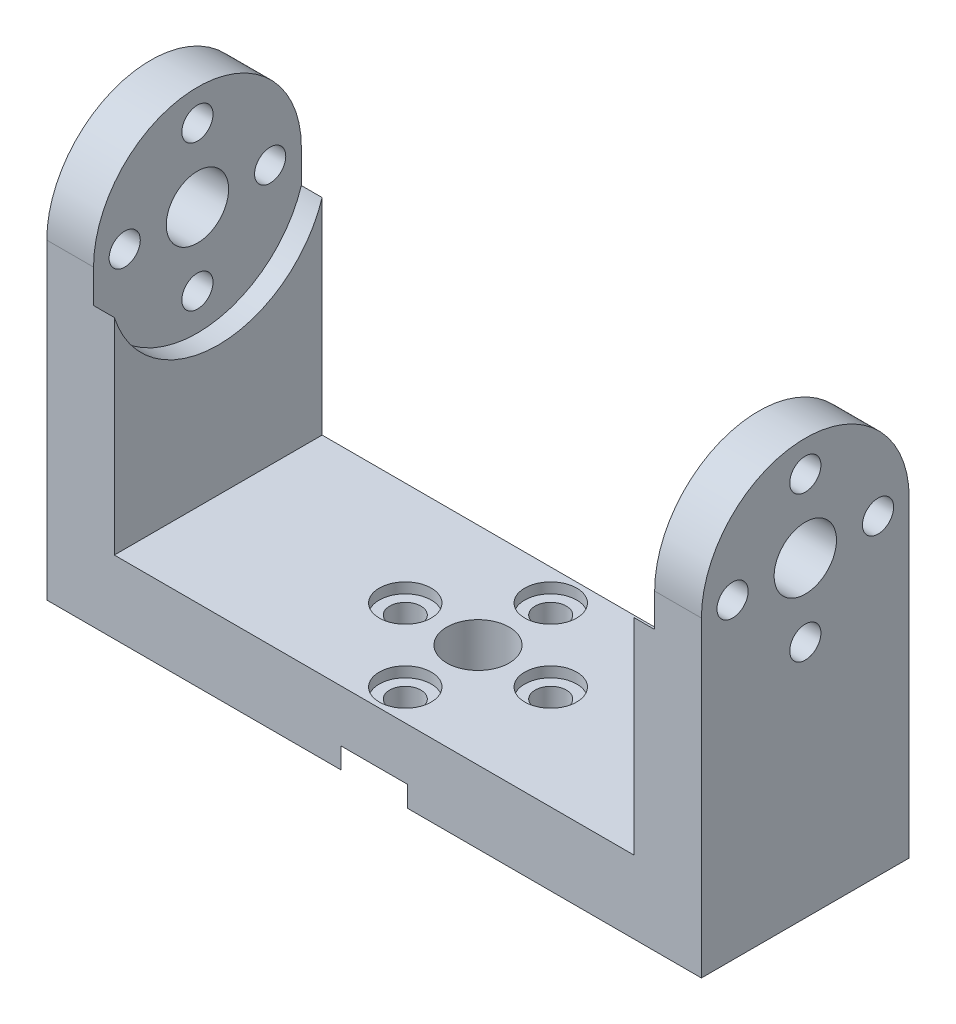
ISO-10303-21;
HEADER;
FILE_DESCRIPTION(('STEP AP214'),'2;1');
FILE_NAME('part.step','',(''),(''),'','','');
FILE_SCHEMA(('AUTOMOTIVE_DESIGN { 1 0 10303 214 1 1 1 1 }'));
ENDSEC;
DATA;
#1=APPLICATION_CONTEXT('core data for automotive mechanical design processes');
#2=APPLICATION_PROTOCOL_DEFINITION('international standard','automotive_design',2000,#1);
#3=PRODUCT_CONTEXT('',#1,'mechanical');
#4=PRODUCT('Part','Part','',(#3));
#5=PRODUCT_RELATED_PRODUCT_CATEGORY('part','',(#4));
#6=PRODUCT_DEFINITION_FORMATION('','',#4);
#7=PRODUCT_DEFINITION_CONTEXT('part definition',#1,'design');
#8=PRODUCT_DEFINITION('design','',#6,#7);
#9=PRODUCT_DEFINITION_SHAPE('','',#8);
#10=(LENGTH_UNIT() NAMED_UNIT(*) SI_UNIT(.MILLI.,.METRE.));
#11=(NAMED_UNIT(*) PLANE_ANGLE_UNIT() SI_UNIT($,.RADIAN.));
#12=(NAMED_UNIT(*) SI_UNIT($,.STERADIAN.) SOLID_ANGLE_UNIT());
#13=UNCERTAINTY_MEASURE_WITH_UNIT(LENGTH_MEASURE(1.E-05),#10,'distance_accuracy_value','');
#14=(GEOMETRIC_REPRESENTATION_CONTEXT(3) GLOBAL_UNCERTAINTY_ASSIGNED_CONTEXT((#13)) GLOBAL_UNIT_ASSIGNED_CONTEXT((#10,
#11,#12)) REPRESENTATION_CONTEXT('',''));
#15=CARTESIAN_POINT('',(0.,0.,0.));
#16=DIRECTION('',(0.,0.,1.));
#17=DIRECTION('',(1.,0.,0.));
#18=AXIS2_PLACEMENT_3D('',#15,#16,#17);
#19=CARTESIAN_POINT('',(25.,5.,9.99999999999999));
#20=DIRECTION('',(0.,0.,-1.));
#21=DIRECTION('',(-1.,0.,0.));
#22=AXIS2_PLACEMENT_3D('',#19,#20,#21);
#23=PLANE('',#22);
#24=DIRECTION('',(-1.,0.,0.));
#25=VECTOR('',#24,1.);
#26=CARTESIAN_POINT('',(3.20156211871643,0.,10.));
#27=LINE('',#26,#25);
#28=CARTESIAN_POINT('',(3.20156211871643,0.,10.));
#29=VERTEX_POINT('',#28);
#30=CARTESIAN_POINT('',(-3.20156211871643,0.,10.));
#31=VERTEX_POINT('',#30);
#32=EDGE_CURVE('E226',#29,#31,#27,.T.);
#33=ORIENTED_EDGE('',*,*,#32,.F.);
#34=DIRECTION('',(0.,-1.,0.));
#35=VECTOR('',#34,1.);
#36=CARTESIAN_POINT('',(3.20156211871643,2.,10.));
#37=LINE('',#36,#35);
#38=CARTESIAN_POINT('',(3.20156211871643,-2.,10.));
#39=VERTEX_POINT('',#38);
#40=EDGE_CURVE('E49',#29,#39,#37,.T.);
#41=ORIENTED_EDGE('',*,*,#40,.T.);
#42=DIRECTION('',(-1.,0.,0.));
#43=VECTOR('',#42,1.);
#44=CARTESIAN_POINT('',(30.,-2.,9.99999999999999));
#45=LINE('',#44,#43);
#46=CARTESIAN_POINT('',(31.5,-2.,9.99999999999999));
#47=VERTEX_POINT('',#46);
#48=EDGE_CURVE('E241',#47,#39,#45,.T.);
#49=ORIENTED_EDGE('',*,*,#48,.F.);
#50=DIRECTION('',(0.,-1.,0.));
#51=VECTOR('',#50,1.);
#52=CARTESIAN_POINT('',(31.5,28.,10.));
#53=LINE('',#52,#51);
#54=CARTESIAN_POINT('',(31.5,28.,10.));
#55=VERTEX_POINT('',#54);
#56=EDGE_CURVE('E201',#55,#47,#53,.T.);
#57=ORIENTED_EDGE('',*,*,#56,.F.);
#58=DIRECTION('',(1.,0.,0.));
#59=VECTOR('',#58,1.);
#60=CARTESIAN_POINT('',(-25.,28.,10.));
#61=LINE('',#60,#59);
#62=CARTESIAN_POINT('',(27.,28.,10.));
#63=VERTEX_POINT('',#62);
#64=EDGE_CURVE('E155',#63,#55,#61,.T.);
#65=ORIENTED_EDGE('',*,*,#64,.F.);
#66=DIRECTION('',(0.,-1.,0.));
#67=VECTOR('',#66,1.);
#68=CARTESIAN_POINT('',(27.,28.,10.));
#69=LINE('',#68,#67);
#70=CARTESIAN_POINT('',(27.,24.7984378812836,10.));
#71=VERTEX_POINT('',#70);
#72=EDGE_CURVE('E261',#63,#71,#69,.T.);
#73=ORIENTED_EDGE('',*,*,#72,.T.);
#74=DIRECTION('',(-1.,0.,0.));
#75=VECTOR('',#74,1.);
#76=CARTESIAN_POINT('',(27.,24.7984378812836,10.));
#77=LINE('',#76,#75);
#78=CARTESIAN_POINT('',(25.,24.7984378812836,10.));
#79=VERTEX_POINT('',#78);
#80=EDGE_CURVE('E273',#71,#79,#77,.T.);
#81=ORIENTED_EDGE('',*,*,#80,.T.);
#82=DIRECTION('',(0.,-1.,0.));
#83=VECTOR('',#82,1.);
#84=CARTESIAN_POINT('',(25.,24.7984378812836,10.));
#85=LINE('',#84,#83);
#86=CARTESIAN_POINT('',(25.,5.,10.));
#87=VERTEX_POINT('',#86);
#88=EDGE_CURVE('E315',#79,#87,#85,.T.);
#89=ORIENTED_EDGE('',*,*,#88,.T.);
#90=DIRECTION('',(1.,0.,0.));
#91=VECTOR('',#90,1.);
#92=CARTESIAN_POINT('',(25.,5.,9.99999999999999));
#93=LINE('',#92,#91);
#94=CARTESIAN_POINT('',(-25.,5.,10.));
#95=VERTEX_POINT('',#94);
#96=EDGE_CURVE('E361',#95,#87,#93,.T.);
#97=ORIENTED_EDGE('',*,*,#96,.F.);
#98=DIRECTION('',(0.,-1.,0.));
#99=VECTOR('',#98,1.);
#100=CARTESIAN_POINT('',(-25.,24.7984378812836,10.));
#101=LINE('',#100,#99);
#102=CARTESIAN_POINT('',(-25.,24.7984378812836,10.));
#103=VERTEX_POINT('',#102);
#104=EDGE_CURVE('E304',#103,#95,#101,.T.);
#105=ORIENTED_EDGE('',*,*,#104,.F.);
#106=CARTESIAN_POINT('',(-27.,24.7984378812836,10.));
#107=VERTEX_POINT('',#106);
#108=EDGE_CURVE('E272',#103,#107,#77,.T.);
#109=ORIENTED_EDGE('',*,*,#108,.T.);
#110=DIRECTION('',(0.,-1.,0.));
#111=VECTOR('',#110,1.);
#112=CARTESIAN_POINT('',(-27.,28.,10.));
#113=LINE('',#112,#111);
#114=CARTESIAN_POINT('',(-27.,28.,10.));
#115=VERTEX_POINT('',#114);
#116=EDGE_CURVE('E250',#115,#107,#113,.T.);
#117=ORIENTED_EDGE('',*,*,#116,.F.);
#118=CARTESIAN_POINT('',(-31.5,28.,10.));
#119=VERTEX_POINT('',#118);
#120=EDGE_CURVE('E324',#119,#115,#61,.T.);
#121=ORIENTED_EDGE('',*,*,#120,.F.);
#122=DIRECTION('',(0.,1.,0.));
#123=VECTOR('',#122,1.);
#124=CARTESIAN_POINT('',(-31.5,-2.,10.));
#125=LINE('',#124,#123);
#126=CARTESIAN_POINT('',(-31.5,-2.,10.));
#127=VERTEX_POINT('',#126);
#128=EDGE_CURVE('E173',#127,#119,#125,.T.);
#129=ORIENTED_EDGE('',*,*,#128,.F.);
#130=DIRECTION('',(-1.,0.,0.));
#131=VECTOR('',#130,1.);
#132=CARTESIAN_POINT('',(-3.20156211871643,-2.,10.));
#133=LINE('',#132,#131);
#134=CARTESIAN_POINT('',(-3.20156211871643,-2.,10.));
#135=VERTEX_POINT('',#134);
#136=EDGE_CURVE('E239',#135,#127,#133,.T.);
#137=ORIENTED_EDGE('',*,*,#136,.F.);
#138=DIRECTION('',(0.,-1.,0.));
#139=VECTOR('',#138,1.);
#140=CARTESIAN_POINT('',(-3.20156211871643,2.,10.));
#141=LINE('',#140,#139);
#142=EDGE_CURVE('E354',#135,#31,#141,.F.);
#143=ORIENTED_EDGE('',*,*,#142,.T.);
#144=EDGE_LOOP('',(#33,#41,#49,#57,#65,#73,#81,#89,#97,#105,#109,#117,#121,#129,#137,#143));
#145=FACE_BOUND('',#144,.T.);
#146=ADVANCED_FACE('F33',(#145),#23,.F.);
#147=CARTESIAN_POINT('',(25.,5.,-10.));
#148=DIRECTION('',(0.,0.,1.));
#149=DIRECTION('',(1.,0.,0.));
#150=AXIS2_PLACEMENT_3D('',#147,#148,#149);
#151=PLANE('',#150);
#152=DIRECTION('',(1.,0.,0.));
#153=VECTOR('',#152,1.);
#154=CARTESIAN_POINT('',(-3.20156211871642,0.,-10.));
#155=LINE('',#154,#153);
#156=CARTESIAN_POINT('',(-3.20156211871642,0.,-10.));
#157=VERTEX_POINT('',#156);
#158=CARTESIAN_POINT('',(3.20156211871641,0.,-10.));
#159=VERTEX_POINT('',#158);
#160=EDGE_CURVE('E232',#157,#159,#155,.T.);
#161=ORIENTED_EDGE('',*,*,#160,.F.);
#162=DIRECTION('',(0.,-1.,0.));
#163=VECTOR('',#162,1.);
#164=CARTESIAN_POINT('',(-3.20156211871642,2.,-10.));
#165=LINE('',#164,#163);
#166=CARTESIAN_POINT('',(-3.20156211871642,-2.,-10.));
#167=VERTEX_POINT('',#166);
#168=EDGE_CURVE('E11',#157,#167,#165,.T.);
#169=ORIENTED_EDGE('',*,*,#168,.T.);
#170=DIRECTION('',(1.,0.,0.));
#171=VECTOR('',#170,1.);
#172=CARTESIAN_POINT('',(-30.,-2.,-10.));
#173=LINE('',#172,#171);
#174=CARTESIAN_POINT('',(-31.5,-2.,-10.));
#175=VERTEX_POINT('',#174);
#176=EDGE_CURVE('E163',#175,#167,#173,.T.);
#177=ORIENTED_EDGE('',*,*,#176,.F.);
#178=DIRECTION('',(0.,-1.,0.));
#179=VECTOR('',#178,1.);
#180=CARTESIAN_POINT('',(-31.5,28.,-10.));
#181=LINE('',#180,#179);
#182=CARTESIAN_POINT('',(-31.5,28.,-10.));
#183=VERTEX_POINT('',#182);
#184=EDGE_CURVE('E159',#183,#175,#181,.T.);
#185=ORIENTED_EDGE('',*,*,#184,.F.);
#186=DIRECTION('',(1.,0.,0.));
#187=VECTOR('',#186,1.);
#188=CARTESIAN_POINT('',(-25.,28.,-10.));
#189=LINE('',#188,#187);
#190=CARTESIAN_POINT('',(-27.,28.,-10.));
#191=VERTEX_POINT('',#190);
#192=EDGE_CURVE('E146',#183,#191,#189,.T.);
#193=ORIENTED_EDGE('',*,*,#192,.T.);
#194=DIRECTION('',(0.,1.,0.));
#195=VECTOR('',#194,1.);
#196=CARTESIAN_POINT('',(-27.,24.7984378812836,-10.));
#197=LINE('',#196,#195);
#198=CARTESIAN_POINT('',(-27.,24.7984378812836,-10.));
#199=VERTEX_POINT('',#198);
#200=EDGE_CURVE('E256',#199,#191,#197,.T.);
#201=ORIENTED_EDGE('',*,*,#200,.F.);
#202=DIRECTION('',(-1.,0.,0.));
#203=VECTOR('',#202,1.);
#204=CARTESIAN_POINT('',(27.,24.7984378812836,-10.));
#205=LINE('',#204,#203);
#206=CARTESIAN_POINT('',(-25.,24.7984378812836,-10.));
#207=VERTEX_POINT('',#206);
#208=EDGE_CURVE('E269',#207,#199,#205,.T.);
#209=ORIENTED_EDGE('',*,*,#208,.F.);
#210=DIRECTION('',(0.,1.,0.));
#211=VECTOR('',#210,1.);
#212=CARTESIAN_POINT('',(-25.,5.,-10.));
#213=LINE('',#212,#211);
#214=CARTESIAN_POINT('',(-25.,5.,-10.));
#215=VERTEX_POINT('',#214);
#216=EDGE_CURVE('E310',#215,#207,#213,.T.);
#217=ORIENTED_EDGE('',*,*,#216,.F.);
#218=DIRECTION('',(-1.,0.,0.));
#219=VECTOR('',#218,1.);
#220=CARTESIAN_POINT('',(25.,5.,-10.));
#221=LINE('',#220,#219);
#222=CARTESIAN_POINT('',(25.,5.,-10.));
#223=VERTEX_POINT('',#222);
#224=EDGE_CURVE('E368',#223,#215,#221,.T.);
#225=ORIENTED_EDGE('',*,*,#224,.F.);
#226=DIRECTION('',(0.,1.,0.));
#227=VECTOR('',#226,1.);
#228=CARTESIAN_POINT('',(25.,5.,-10.));
#229=LINE('',#228,#227);
#230=CARTESIAN_POINT('',(25.,24.7984378812836,-10.));
#231=VERTEX_POINT('',#230);
#232=EDGE_CURVE('E321',#223,#231,#229,.T.);
#233=ORIENTED_EDGE('',*,*,#232,.T.);
#234=CARTESIAN_POINT('',(27.,24.7984378812836,-10.));
#235=VERTEX_POINT('',#234);
#236=EDGE_CURVE('E270',#235,#231,#205,.T.);
#237=ORIENTED_EDGE('',*,*,#236,.F.);
#238=DIRECTION('',(0.,1.,0.));
#239=VECTOR('',#238,1.);
#240=CARTESIAN_POINT('',(27.,24.7984378812836,-10.));
#241=LINE('',#240,#239);
#242=CARTESIAN_POINT('',(27.,28.,-10.));
#243=VERTEX_POINT('',#242);
#244=EDGE_CURVE('E266',#235,#243,#241,.T.);
#245=ORIENTED_EDGE('',*,*,#244,.T.);
#246=CARTESIAN_POINT('',(31.5,28.,-10.));
#247=VERTEX_POINT('',#246);
#248=EDGE_CURVE('E156',#243,#247,#189,.T.);
#249=ORIENTED_EDGE('',*,*,#248,.T.);
#250=DIRECTION('',(0.,1.,0.));
#251=VECTOR('',#250,1.);
#252=CARTESIAN_POINT('',(31.5,-2.,-10.));
#253=LINE('',#252,#251);
#254=CARTESIAN_POINT('',(31.5,-2.,-10.));
#255=VERTEX_POINT('',#254);
#256=EDGE_CURVE('E207',#255,#247,#253,.T.);
#257=ORIENTED_EDGE('',*,*,#256,.F.);
#258=DIRECTION('',(1.,0.,0.));
#259=VECTOR('',#258,1.);
#260=CARTESIAN_POINT('',(3.20156211871641,-2.,-10.));
#261=LINE('',#260,#259);
#262=CARTESIAN_POINT('',(3.20156211871641,-2.,-10.));
#263=VERTEX_POINT('',#262);
#264=EDGE_CURVE('E247',#263,#255,#261,.T.);
#265=ORIENTED_EDGE('',*,*,#264,.F.);
#266=DIRECTION('',(0.,-1.,0.));
#267=VECTOR('',#266,1.);
#268=CARTESIAN_POINT('',(3.20156211871641,2.,-10.));
#269=LINE('',#268,#267);
#270=EDGE_CURVE('E41',#263,#159,#269,.F.);
#271=ORIENTED_EDGE('',*,*,#270,.T.);
#272=EDGE_LOOP('',(#161,#169,#177,#185,#193,#201,#209,#217,#225,#233,#237,#245,#249,#257,#265,#271));
#273=FACE_BOUND('',#272,.T.);
#274=ADVANCED_FACE('F161',(#273),#151,.F.);
#275=CARTESIAN_POINT('',(-25.,28.,0.));
#276=DIRECTION('',(1.,0.,0.));
#277=DIRECTION('',(0.,0.,-1.));
#278=AXIS2_PLACEMENT_3D('',#275,#276,#277);
#279=CYLINDRICAL_SURFACE('',#278,3.);
#280=CARTESIAN_POINT('',(-27.,28.,0.));
#281=DIRECTION('',(1.,0.,0.));
#282=DIRECTION('',(0.,0.,-1.));
#283=AXIS2_PLACEMENT_3D('',#280,#281,#282);
#284=CIRCLE('',#283,3.);
#285=CARTESIAN_POINT('',(-27.,28.,-3.));
#286=VERTEX_POINT('',#285);
#287=EDGE_CURVE('E298',#286,#286,#284,.F.);
#288=ORIENTED_EDGE('',*,*,#287,.F.);
#289=EDGE_LOOP('',(#288));
#290=FACE_BOUND('',#289,.T.);
#291=CARTESIAN_POINT('',(-31.5,28.,0.));
#292=DIRECTION('',(-1.,0.,0.));
#293=DIRECTION('',(0.,0.,1.));
#294=AXIS2_PLACEMENT_3D('',#291,#292,#293);
#295=CIRCLE('',#294,3.);
#296=CARTESIAN_POINT('',(-31.5,28.,3.));
#297=VERTEX_POINT('',#296);
#298=EDGE_CURVE('E177',#297,#297,#295,.T.);
#299=ORIENTED_EDGE('',*,*,#298,.T.);
#300=EDGE_LOOP('',(#299));
#301=FACE_BOUND('',#300,.T.);
#302=ADVANCED_FACE('F426',(#290,#301),#279,.F.);
#303=CARTESIAN_POINT('',(-25.,28.,0.));
#304=DIRECTION('',(1.,0.,0.));
#305=DIRECTION('',(0.,0.,-1.));
#306=AXIS2_PLACEMENT_3D('',#303,#304,#305);
#307=CYLINDRICAL_SURFACE('',#306,10.);
#308=CARTESIAN_POINT('',(-27.,28.,0.));
#309=DIRECTION('',(1.,0.,0.));
#310=DIRECTION('',(0.,0.,-1.));
#311=AXIS2_PLACEMENT_3D('',#308,#309,#310);
#312=CIRCLE('',#311,10.);
#313=EDGE_CURVE('E152',#191,#115,#312,.T.);
#314=ORIENTED_EDGE('',*,*,#313,.F.);
#315=ORIENTED_EDGE('',*,*,#192,.F.);
#316=CARTESIAN_POINT('',(-31.5,28.,0.));
#317=DIRECTION('',(-1.,0.,0.));
#318=DIRECTION('',(0.,0.,1.));
#319=AXIS2_PLACEMENT_3D('',#316,#317,#318);
#320=CIRCLE('',#319,10.);
#321=EDGE_CURVE('E151',#119,#183,#320,.T.);
#322=ORIENTED_EDGE('',*,*,#321,.F.);
#323=ORIENTED_EDGE('',*,*,#120,.T.);
#324=EDGE_LOOP('',(#314,#315,#322,#323));
#325=FACE_BOUND('',#324,.T.);
#326=ADVANCED_FACE('F148',(#325),#307,.T.);
#327=CARTESIAN_POINT('',(28.,35.,0.));
#328=DIRECTION('',(-1.,0.,0.));
#329=DIRECTION('',(0.,0.,1.));
#330=AXIS2_PLACEMENT_3D('',#327,#328,#329);
#331=CYLINDRICAL_SURFACE('',#330,1.5);
#332=CARTESIAN_POINT('',(-27.,35.,0.));
#333=DIRECTION('',(1.,0.,0.));
#334=DIRECTION('',(0.,0.,-1.));
#335=AXIS2_PLACEMENT_3D('',#332,#333,#334);
#336=CIRCLE('',#335,1.5);
#337=CARTESIAN_POINT('',(-27.,35.,-1.5));
#338=VERTEX_POINT('',#337);
#339=EDGE_CURVE('E295',#338,#338,#336,.T.);
#340=ORIENTED_EDGE('',*,*,#339,.T.);
#341=EDGE_LOOP('',(#340));
#342=FACE_BOUND('',#341,.T.);
#343=CARTESIAN_POINT('',(-31.5,35.,0.));
#344=DIRECTION('',(-1.,0.,0.));
#345=DIRECTION('',(0.,0.,1.));
#346=AXIS2_PLACEMENT_3D('',#343,#344,#345);
#347=CIRCLE('',#346,1.5);
#348=CARTESIAN_POINT('',(-31.5,35.,1.5));
#349=VERTEX_POINT('',#348);
#350=EDGE_CURVE('E557',#349,#349,#347,.T.);
#351=ORIENTED_EDGE('',*,*,#350,.T.);
#352=EDGE_LOOP('',(#351));
#353=FACE_BOUND('',#352,.T.);
#354=ADVANCED_FACE('F406',(#342,#353),#331,.F.);
#355=CARTESIAN_POINT('',(28.,28.,-7.));
#356=DIRECTION('',(-1.,0.,0.));
#357=DIRECTION('',(0.,0.,1.));
#358=AXIS2_PLACEMENT_3D('',#355,#356,#357);
#359=CYLINDRICAL_SURFACE('',#358,1.5);
#360=CARTESIAN_POINT('',(-27.,28.,-7.));
#361=DIRECTION('',(1.,0.,0.));
#362=DIRECTION('',(0.,0.,-1.));
#363=AXIS2_PLACEMENT_3D('',#360,#361,#362);
#364=CIRCLE('',#363,1.5);
#365=CARTESIAN_POINT('',(-27.,28.,-8.5));
#366=VERTEX_POINT('',#365);
#367=EDGE_CURVE('E292',#366,#366,#364,.T.);
#368=ORIENTED_EDGE('',*,*,#367,.T.);
#369=EDGE_LOOP('',(#368));
#370=FACE_BOUND('',#369,.T.);
#371=CARTESIAN_POINT('',(-31.5,28.,-7.));
#372=DIRECTION('',(-1.,0.,0.));
#373=DIRECTION('',(0.,0.,1.));
#374=AXIS2_PLACEMENT_3D('',#371,#372,#373);
#375=CIRCLE('',#374,1.5);
#376=CARTESIAN_POINT('',(-31.5,28.,-5.5));
#377=VERTEX_POINT('',#376);
#378=EDGE_CURVE('E555',#377,#377,#375,.T.);
#379=ORIENTED_EDGE('',*,*,#378,.T.);
#380=EDGE_LOOP('',(#379));
#381=FACE_BOUND('',#380,.T.);
#382=ADVANCED_FACE('F413',(#370,#381),#359,.F.);
#383=CARTESIAN_POINT('',(28.,21.,0.));
#384=DIRECTION('',(-1.,0.,0.));
#385=DIRECTION('',(0.,0.,1.));
#386=AXIS2_PLACEMENT_3D('',#383,#384,#385);
#387=CYLINDRICAL_SURFACE('',#386,1.5);
#388=CARTESIAN_POINT('',(-27.,21.,0.));
#389=DIRECTION('',(1.,0.,0.));
#390=DIRECTION('',(0.,0.,-1.));
#391=AXIS2_PLACEMENT_3D('',#388,#389,#390);
#392=CIRCLE('',#391,1.5);
#393=CARTESIAN_POINT('',(-27.,21.,-1.49999999999995));
#394=VERTEX_POINT('',#393);
#395=EDGE_CURVE('E289',#394,#394,#392,.T.);
#396=ORIENTED_EDGE('',*,*,#395,.T.);
#397=EDGE_LOOP('',(#396));
#398=FACE_BOUND('',#397,.T.);
#399=CARTESIAN_POINT('',(-31.5,21.,0.));
#400=DIRECTION('',(-1.,0.,0.));
#401=DIRECTION('',(0.,0.,1.));
#402=AXIS2_PLACEMENT_3D('',#399,#400,#401);
#403=CIRCLE('',#402,1.5);
#404=CARTESIAN_POINT('',(-31.5,21.,1.50000000000005));
#405=VERTEX_POINT('',#404);
#406=EDGE_CURVE('E174',#405,#405,#403,.T.);
#407=ORIENTED_EDGE('',*,*,#406,.T.);
#408=EDGE_LOOP('',(#407));
#409=FACE_BOUND('',#408,.T.);
#410=ADVANCED_FACE('F487',(#398,#409),#387,.F.);
#411=CARTESIAN_POINT('',(28.,28.0000000000001,7.));
#412=DIRECTION('',(-1.,0.,0.));
#413=DIRECTION('',(0.,0.,1.));
#414=AXIS2_PLACEMENT_3D('',#411,#412,#413);
#415=CYLINDRICAL_SURFACE('',#414,1.5);
#416=CARTESIAN_POINT('',(-27.,28.0000000000001,7.));
#417=DIRECTION('',(1.,0.,0.));
#418=DIRECTION('',(0.,0.,-1.));
#419=AXIS2_PLACEMENT_3D('',#416,#417,#418);
#420=CIRCLE('',#419,1.5);
#421=CARTESIAN_POINT('',(-27.,28.0000000000001,5.5));
#422=VERTEX_POINT('',#421);
#423=EDGE_CURVE('E36',#422,#422,#420,.T.);
#424=ORIENTED_EDGE('',*,*,#423,.T.);
#425=EDGE_LOOP('',(#424));
#426=FACE_BOUND('',#425,.T.);
#427=CARTESIAN_POINT('',(-31.5,28.0000000000001,7.));
#428=DIRECTION('',(-1.,0.,0.));
#429=DIRECTION('',(0.,0.,1.));
#430=AXIS2_PLACEMENT_3D('',#427,#428,#429);
#431=CIRCLE('',#430,1.5);
#432=CARTESIAN_POINT('',(-31.5,28.0000000000001,8.5));
#433=VERTEX_POINT('',#432);
#434=EDGE_CURVE('E560',#433,#433,#431,.T.);
#435=ORIENTED_EDGE('',*,*,#434,.T.);
#436=EDGE_LOOP('',(#435));
#437=FACE_BOUND('',#436,.T.);
#438=ADVANCED_FACE('F382',(#426,#437),#415,.F.);
#439=CARTESIAN_POINT('',(0.,5.,0.));
#440=DIRECTION('',(0.,1.,0.));
#441=DIRECTION('',(0.,0.,1.));
#442=AXIS2_PLACEMENT_3D('',#439,#440,#441);
#443=PLANE('',#442);
#444=CARTESIAN_POINT('',(0.,5.,0.));
#445=DIRECTION('',(0.,1.,0.));
#446=DIRECTION('',(0.,0.,1.));
#447=AXIS2_PLACEMENT_3D('',#444,#445,#446);
#448=CIRCLE('',#447,3.);
#449=CARTESIAN_POINT('',(0.,5.,3.));
#450=VERTEX_POINT('',#449);
#451=EDGE_CURVE('E358',#450,#450,#448,.T.);
#452=ORIENTED_EDGE('',*,*,#451,.F.);
#453=EDGE_LOOP('',(#452));
#454=FACE_BOUND('',#453,.T.);
#455=CARTESIAN_POINT('',(0.,5.,-7.));
#456=DIRECTION('',(0.,1.,0.));
#457=DIRECTION('',(0.,0.,1.));
#458=AXIS2_PLACEMENT_3D('',#455,#456,#457);
#459=CIRCLE('',#458,2.5);
#460=CARTESIAN_POINT('',(0.,5.,-4.5));
#461=VERTEX_POINT('',#460);
#462=EDGE_CURVE('E351',#461,#461,#459,.T.);
#463=ORIENTED_EDGE('',*,*,#462,.F.);
#464=EDGE_LOOP('',(#463));
#465=FACE_BOUND('',#464,.T.);
#466=CARTESIAN_POINT('',(7.0000000000002,5.,-1.98094713253425E-13));
#467=DIRECTION('',(0.,1.,0.));
#468=DIRECTION('',(0.,0.,1.));
#469=AXIS2_PLACEMENT_3D('',#466,#467,#468);
#470=CIRCLE('',#469,2.50000000000016);
#471=CARTESIAN_POINT('',(7.0000000000002,5.,2.49999999999996));
#472=VERTEX_POINT('',#471);
#473=EDGE_CURVE('E344',#472,#472,#470,.T.);
#474=ORIENTED_EDGE('',*,*,#473,.F.);
#475=EDGE_LOOP('',(#474));
#476=FACE_BOUND('',#475,.T.);
#477=CARTESIAN_POINT('',(3.9618942650685E-13,5.,7.));
#478=DIRECTION('',(0.,1.,0.));
#479=DIRECTION('',(0.,0.,1.));
#480=AXIS2_PLACEMENT_3D('',#477,#478,#479);
#481=CIRCLE('',#480,2.50000000000043);
#482=CARTESIAN_POINT('',(3.9618942650685E-13,5.,9.50000000000043));
#483=VERTEX_POINT('',#482);
#484=EDGE_CURVE('E337',#483,#483,#481,.T.);
#485=ORIENTED_EDGE('',*,*,#484,.F.);
#486=EDGE_LOOP('',(#485));
#487=FACE_BOUND('',#486,.T.);
#488=CARTESIAN_POINT('',(-6.9999999999998,5.,1.98951966012828E-13));
#489=DIRECTION('',(0.,1.,0.));
#490=DIRECTION('',(0.,0.,1.));
#491=AXIS2_PLACEMENT_3D('',#488,#489,#490);
#492=CIRCLE('',#491,2.50000000000032);
#493=CARTESIAN_POINT('',(-6.9999999999998,5.,2.50000000000052));
#494=VERTEX_POINT('',#493);
#495=EDGE_CURVE('E325',#494,#494,#492,.T.);
#496=ORIENTED_EDGE('',*,*,#495,.F.);
#497=EDGE_LOOP('',(#496));
#498=FACE_BOUND('',#497,.T.);
#499=ORIENTED_EDGE('',*,*,#224,.T.);
#500=DIRECTION('',(0.,0.,-1.));
#501=VECTOR('',#500,1.);
#502=CARTESIAN_POINT('',(-25.,5.,10.));
#503=LINE('',#502,#501);
#504=EDGE_CURVE('E307',#95,#215,#503,.T.);
#505=ORIENTED_EDGE('',*,*,#504,.F.);
#506=ORIENTED_EDGE('',*,*,#96,.T.);
#507=DIRECTION('',(0.,0.,-1.));
#508=VECTOR('',#507,1.);
#509=CARTESIAN_POINT('',(25.,5.,10.));
#510=LINE('',#509,#508);
#511=EDGE_CURVE('E318',#87,#223,#510,.T.);
#512=ORIENTED_EDGE('',*,*,#511,.T.);
#513=EDGE_LOOP('',(#499,#505,#506,#512));
#514=FACE_BOUND('',#513,.T.);
#515=ADVANCED_FACE('F447',(#454,#465,#476,#487,#498,#514),#443,.T.);
#516=CARTESIAN_POINT('',(-7.,6.,0.));
#517=DIRECTION('',(0.,-1.,0.));
#518=DIRECTION('',(0.,0.,-1.));
#519=AXIS2_PLACEMENT_3D('',#516,#517,#518);
#520=CYLINDRICAL_SURFACE('',#519,1.5);
#521=CARTESIAN_POINT('',(-7.,4.,0.));
#522=DIRECTION('',(0.,1.,0.));
#523=DIRECTION('',(0.,0.,1.));
#524=AXIS2_PLACEMENT_3D('',#521,#522,#523);
#525=CIRCLE('',#524,1.5);
#526=CARTESIAN_POINT('',(-7.,4.,1.5));
#527=VERTEX_POINT('',#526);
#528=EDGE_CURVE('E330',#527,#527,#525,.F.);
#529=ORIENTED_EDGE('',*,*,#528,.F.);
#530=EDGE_LOOP('',(#529));
#531=FACE_BOUND('',#530,.T.);
#532=CARTESIAN_POINT('',(-7.,0.,0.));
#533=DIRECTION('',(0.,-1.,0.));
#534=DIRECTION('',(0.,0.,-1.));
#535=AXIS2_PLACEMENT_3D('',#532,#533,#534);
#536=CIRCLE('',#535,1.5);
#537=CARTESIAN_POINT('',(-7.,0.,-1.5));
#538=VERTEX_POINT('',#537);
#539=EDGE_CURVE('E213',#538,#538,#536,.T.);
#540=ORIENTED_EDGE('',*,*,#539,.T.);
#541=EDGE_LOOP('',(#540));
#542=FACE_BOUND('',#541,.T.);
#543=ADVANCED_FACE('F443',(#531,#542),#520,.F.);
#544=CARTESIAN_POINT('',(0.,6.,7.));
#545=DIRECTION('',(0.,-1.,0.));
#546=DIRECTION('',(0.,0.,-1.));
#547=AXIS2_PLACEMENT_3D('',#544,#545,#546);
#548=CYLINDRICAL_SURFACE('',#547,1.5);
#549=CARTESIAN_POINT('',(0.,4.,7.));
#550=DIRECTION('',(0.,1.,0.));
#551=DIRECTION('',(0.,0.,1.));
#552=AXIS2_PLACEMENT_3D('',#549,#550,#551);
#553=CIRCLE('',#552,1.5);
#554=CARTESIAN_POINT('',(0.,4.,8.5));
#555=VERTEX_POINT('',#554);
#556=EDGE_CURVE('E336',#555,#555,#553,.F.);
#557=ORIENTED_EDGE('',*,*,#556,.F.);
#558=EDGE_LOOP('',(#557));
#559=FACE_BOUND('',#558,.T.);
#560=CARTESIAN_POINT('',(0.,0.,7.));
#561=DIRECTION('',(0.,-1.,0.));
#562=DIRECTION('',(0.,0.,-1.));
#563=AXIS2_PLACEMENT_3D('',#560,#561,#562);
#564=CIRCLE('',#563,1.5);
#565=CARTESIAN_POINT('',(0.,0.,5.5));
#566=VERTEX_POINT('',#565);
#567=EDGE_CURVE('E216',#566,#566,#564,.T.);
#568=ORIENTED_EDGE('',*,*,#567,.T.);
#569=EDGE_LOOP('',(#568));
#570=FACE_BOUND('',#569,.T.);
#571=ADVANCED_FACE('F446',(#559,#570),#548,.F.);
#572=CARTESIAN_POINT('',(7.,6.,0.));
#573=DIRECTION('',(0.,-1.,0.));
#574=DIRECTION('',(0.,0.,-1.));
#575=AXIS2_PLACEMENT_3D('',#572,#573,#574);
#576=CYLINDRICAL_SURFACE('',#575,1.5);
#577=CARTESIAN_POINT('',(7.,4.,0.));
#578=DIRECTION('',(0.,1.,0.));
#579=DIRECTION('',(0.,0.,1.));
#580=AXIS2_PLACEMENT_3D('',#577,#578,#579);
#581=CIRCLE('',#580,1.5);
#582=CARTESIAN_POINT('',(7.,4.,1.5));
#583=VERTEX_POINT('',#582);
#584=EDGE_CURVE('E343',#583,#583,#581,.F.);
#585=ORIENTED_EDGE('',*,*,#584,.F.);
#586=EDGE_LOOP('',(#585));
#587=FACE_BOUND('',#586,.T.);
#588=CARTESIAN_POINT('',(7.,0.,0.));
#589=DIRECTION('',(0.,-1.,0.));
#590=DIRECTION('',(0.,0.,-1.));
#591=AXIS2_PLACEMENT_3D('',#588,#589,#590);
#592=CIRCLE('',#591,1.5);
#593=CARTESIAN_POINT('',(7.,0.,-1.5));
#594=VERTEX_POINT('',#593);
#595=EDGE_CURVE('E219',#594,#594,#592,.T.);
#596=ORIENTED_EDGE('',*,*,#595,.T.);
#597=EDGE_LOOP('',(#596));
#598=FACE_BOUND('',#597,.T.);
#599=ADVANCED_FACE('F457',(#587,#598),#576,.F.);
#600=CARTESIAN_POINT('',(0.,6.,-7.));
#601=DIRECTION('',(0.,-1.,0.));
#602=DIRECTION('',(0.,0.,-1.));
#603=AXIS2_PLACEMENT_3D('',#600,#601,#602);
#604=CYLINDRICAL_SURFACE('',#603,1.5);
#605=CARTESIAN_POINT('',(0.,4.,-7.));
#606=DIRECTION('',(0.,1.,0.));
#607=DIRECTION('',(0.,0.,1.));
#608=AXIS2_PLACEMENT_3D('',#605,#606,#607);
#609=CIRCLE('',#608,1.5);
#610=CARTESIAN_POINT('',(0.,4.,-5.5));
#611=VERTEX_POINT('',#610);
#612=EDGE_CURVE('E350',#611,#611,#609,.F.);
#613=ORIENTED_EDGE('',*,*,#612,.F.);
#614=EDGE_LOOP('',(#613));
#615=FACE_BOUND('',#614,.T.);
#616=CARTESIAN_POINT('',(0.,0.,-7.));
#617=DIRECTION('',(0.,-1.,0.));
#618=DIRECTION('',(0.,0.,-1.));
#619=AXIS2_PLACEMENT_3D('',#616,#617,#618);
#620=CIRCLE('',#619,1.5);
#621=CARTESIAN_POINT('',(0.,0.,-8.5));
#622=VERTEX_POINT('',#621);
#623=EDGE_CURVE('E210',#622,#622,#620,.T.);
#624=ORIENTED_EDGE('',*,*,#623,.T.);
#625=EDGE_LOOP('',(#624));
#626=FACE_BOUND('',#625,.T.);
#627=ADVANCED_FACE('F459',(#615,#626),#604,.F.);
#628=CARTESIAN_POINT('',(0.,5.,0.));
#629=DIRECTION('',(0.,-1.,0.));
#630=DIRECTION('',(0.,0.,-1.));
#631=AXIS2_PLACEMENT_3D('',#628,#629,#630);
#632=CYLINDRICAL_SURFACE('',#631,3.);
#633=ORIENTED_EDGE('',*,*,#451,.T.);
#634=EDGE_LOOP('',(#633));
#635=FACE_BOUND('',#634,.T.);
#636=CARTESIAN_POINT('',(0.,0.,0.));
#637=DIRECTION('',(0.,-1.,0.));
#638=DIRECTION('',(0.,0.,-1.));
#639=AXIS2_PLACEMENT_3D('',#636,#637,#638);
#640=CIRCLE('',#639,3.);
#641=CARTESIAN_POINT('',(0.,0.,-3.00000000000001));
#642=VERTEX_POINT('',#641);
#643=EDGE_CURVE('E222',#642,#642,#640,.T.);
#644=ORIENTED_EDGE('',*,*,#643,.T.);
#645=EDGE_LOOP('',(#644));
#646=FACE_BOUND('',#645,.T.);
#647=ADVANCED_FACE('F466',(#635,#646),#632,.F.);
#648=CARTESIAN_POINT('',(0.,2.,0.));
#649=DIRECTION('',(0.,-1.,0.));
#650=DIRECTION('',(0.,0.,-1.));
#651=AXIS2_PLACEMENT_3D('',#648,#649,#650);
#652=CYLINDRICAL_SURFACE('',#651,10.5);
#653=ORIENTED_EDGE('',*,*,#40,.F.);
#654=CARTESIAN_POINT('',(0.,0.,0.));
#655=DIRECTION('',(0.,-1.,0.));
#656=DIRECTION('',(0.,0.,-1.));
#657=AXIS2_PLACEMENT_3D('',#654,#655,#656);
#658=CIRCLE('',#657,10.5);
#659=EDGE_CURVE('E54',#159,#29,#658,.T.);
#660=ORIENTED_EDGE('',*,*,#659,.F.);
#661=ORIENTED_EDGE('',*,*,#270,.F.);
#662=CARTESIAN_POINT('',(0.,-2.,0.));
#663=DIRECTION('',(0.,1.,0.));
#664=DIRECTION('',(0.,0.,-1.));
#665=AXIS2_PLACEMENT_3D('',#662,#663,#664);
#666=CIRCLE('',#665,10.5);
#667=EDGE_CURVE('E244',#39,#263,#666,.T.);
#668=ORIENTED_EDGE('',*,*,#667,.F.);
#669=EDGE_LOOP('',(#653,#660,#661,#668));
#670=FACE_BOUND('',#669,.T.);
#671=ADVANCED_FACE('F473',(#670),#652,.F.);
#672=ORIENTED_EDGE('',*,*,#168,.F.);
#673=CARTESIAN_POINT('',(0.,0.,0.));
#674=DIRECTION('',(0.,-1.,0.));
#675=DIRECTION('',(0.,0.,-1.));
#676=AXIS2_PLACEMENT_3D('',#673,#674,#675);
#677=CIRCLE('',#676,10.5);
#678=EDGE_CURVE('E229',#31,#157,#677,.T.);
#679=ORIENTED_EDGE('',*,*,#678,.F.);
#680=ORIENTED_EDGE('',*,*,#142,.F.);
#681=CARTESIAN_POINT('',(0.,-2.,0.));
#682=DIRECTION('',(0.,1.,0.));
#683=DIRECTION('',(0.,0.,-1.));
#684=AXIS2_PLACEMENT_3D('',#681,#682,#683);
#685=CIRCLE('',#684,10.5);
#686=EDGE_CURVE('E236',#167,#135,#685,.T.);
#687=ORIENTED_EDGE('',*,*,#686,.F.);
#688=EDGE_LOOP('',(#672,#679,#680,#687));
#689=FACE_BOUND('',#688,.T.);
#690=ADVANCED_FACE('F476',(#689),#652,.F.);
#691=CARTESIAN_POINT('',(0.,4.,-7.));
#692=DIRECTION('',(0.,1.,0.));
#693=DIRECTION('',(0.,0.,1.));
#694=AXIS2_PLACEMENT_3D('',#691,#692,#693);
#695=PLANE('',#694);
#696=CARTESIAN_POINT('',(0.,4.,-7.));
#697=DIRECTION('',(0.,1.,0.));
#698=DIRECTION('',(0.,0.,1.));
#699=AXIS2_PLACEMENT_3D('',#696,#697,#698);
#700=CIRCLE('',#699,2.5);
#701=CARTESIAN_POINT('',(0.,4.,-4.5));
#702=VERTEX_POINT('',#701);
#703=EDGE_CURVE('E347',#702,#702,#700,.T.);
#704=ORIENTED_EDGE('',*,*,#703,.T.);
#705=EDGE_LOOP('',(#704));
#706=FACE_BOUND('',#705,.T.);
#707=ORIENTED_EDGE('',*,*,#612,.T.);
#708=EDGE_LOOP('',(#707));
#709=FACE_BOUND('',#708,.T.);
#710=ADVANCED_FACE('F787',(#706,#709),#695,.T.);
#711=CARTESIAN_POINT('',(0.,4.,-7.));
#712=DIRECTION('',(0.,1.,0.));
#713=DIRECTION('',(0.,0.,1.));
#714=AXIS2_PLACEMENT_3D('',#711,#712,#713);
#715=CYLINDRICAL_SURFACE('',#714,2.5);
#716=ORIENTED_EDGE('',*,*,#703,.F.);
#717=EDGE_LOOP('',(#716));
#718=FACE_BOUND('',#717,.T.);
#719=ORIENTED_EDGE('',*,*,#462,.T.);
#720=EDGE_LOOP('',(#719));
#721=FACE_BOUND('',#720,.T.);
#722=ADVANCED_FACE('F799',(#718,#721),#715,.F.);
#723=CARTESIAN_POINT('',(7.0000000000002,4.,-1.98094713253425E-13));
#724=DIRECTION('',(0.,1.,0.));
#725=DIRECTION('',(0.,0.,1.));
#726=AXIS2_PLACEMENT_3D('',#723,#724,#725);
#727=PLANE('',#726);
#728=CARTESIAN_POINT('',(7.0000000000002,4.,-1.98094713253425E-13));
#729=DIRECTION('',(0.,1.,0.));
#730=DIRECTION('',(0.,0.,1.));
#731=AXIS2_PLACEMENT_3D('',#728,#729,#730);
#732=CIRCLE('',#731,2.50000000000016);
#733=CARTESIAN_POINT('',(7.0000000000002,4.,2.49999999999996));
#734=VERTEX_POINT('',#733);
#735=EDGE_CURVE('E340',#734,#734,#732,.T.);
#736=ORIENTED_EDGE('',*,*,#735,.T.);
#737=EDGE_LOOP('',(#736));
#738=FACE_BOUND('',#737,.T.);
#739=ORIENTED_EDGE('',*,*,#584,.T.);
#740=EDGE_LOOP('',(#739));
#741=FACE_BOUND('',#740,.T.);
#742=ADVANCED_FACE('F806',(#738,#741),#727,.T.);
#743=CARTESIAN_POINT('',(7.0000000000002,4.,-1.98094713253425E-13));
#744=DIRECTION('',(0.,1.,0.));
#745=DIRECTION('',(0.,0.,1.));
#746=AXIS2_PLACEMENT_3D('',#743,#744,#745);
#747=CYLINDRICAL_SURFACE('',#746,2.50000000000016);
#748=ORIENTED_EDGE('',*,*,#735,.F.);
#749=EDGE_LOOP('',(#748));
#750=FACE_BOUND('',#749,.T.);
#751=ORIENTED_EDGE('',*,*,#473,.T.);
#752=EDGE_LOOP('',(#751));
#753=FACE_BOUND('',#752,.T.);
#754=ADVANCED_FACE('F811',(#750,#753),#747,.F.);
#755=CARTESIAN_POINT('',(3.9618942650685E-13,4.,7.));
#756=DIRECTION('',(0.,1.,0.));
#757=DIRECTION('',(0.,0.,1.));
#758=AXIS2_PLACEMENT_3D('',#755,#756,#757);
#759=PLANE('',#758);
#760=CARTESIAN_POINT('',(3.9618942650685E-13,4.,7.));
#761=DIRECTION('',(0.,1.,0.));
#762=DIRECTION('',(0.,0.,1.));
#763=AXIS2_PLACEMENT_3D('',#760,#761,#762);
#764=CIRCLE('',#763,2.50000000000043);
#765=CARTESIAN_POINT('',(3.9618942650685E-13,4.,9.50000000000043));
#766=VERTEX_POINT('',#765);
#767=EDGE_CURVE('E333',#766,#766,#764,.T.);
#768=ORIENTED_EDGE('',*,*,#767,.T.);
#769=EDGE_LOOP('',(#768));
#770=FACE_BOUND('',#769,.T.);
#771=ORIENTED_EDGE('',*,*,#556,.T.);
#772=EDGE_LOOP('',(#771));
#773=FACE_BOUND('',#772,.T.);
#774=ADVANCED_FACE('F814',(#770,#773),#759,.T.);
#775=CARTESIAN_POINT('',(3.9618942650685E-13,4.,7.));
#776=DIRECTION('',(0.,1.,0.));
#777=DIRECTION('',(0.,0.,1.));
#778=AXIS2_PLACEMENT_3D('',#775,#776,#777);
#779=CYLINDRICAL_SURFACE('',#778,2.50000000000043);
#780=ORIENTED_EDGE('',*,*,#767,.F.);
#781=EDGE_LOOP('',(#780));
#782=FACE_BOUND('',#781,.T.);
#783=ORIENTED_EDGE('',*,*,#484,.T.);
#784=EDGE_LOOP('',(#783));
#785=FACE_BOUND('',#784,.T.);
#786=ADVANCED_FACE('F819',(#782,#785),#779,.F.);
#787=CARTESIAN_POINT('',(-6.9999999999998,4.,1.98951966012828E-13));
#788=DIRECTION('',(0.,1.,0.));
#789=DIRECTION('',(0.,0.,1.));
#790=AXIS2_PLACEMENT_3D('',#787,#788,#789);
#791=PLANE('',#790);
#792=CARTESIAN_POINT('',(-6.9999999999998,4.,1.98951966012828E-13));
#793=DIRECTION('',(0.,1.,0.));
#794=DIRECTION('',(0.,0.,1.));
#795=AXIS2_PLACEMENT_3D('',#792,#793,#794);
#796=CIRCLE('',#795,2.50000000000032);
#797=CARTESIAN_POINT('',(-6.9999999999998,4.,2.50000000000052));
#798=VERTEX_POINT('',#797);
#799=EDGE_CURVE('E327',#798,#798,#796,.T.);
#800=ORIENTED_EDGE('',*,*,#799,.T.);
#801=EDGE_LOOP('',(#800));
#802=FACE_BOUND('',#801,.T.);
#803=ORIENTED_EDGE('',*,*,#528,.T.);
#804=EDGE_LOOP('',(#803));
#805=FACE_BOUND('',#804,.T.);
#806=ADVANCED_FACE('F441',(#802,#805),#791,.T.);
#807=CARTESIAN_POINT('',(-6.9999999999998,4.,1.98951966012828E-13));
#808=DIRECTION('',(0.,1.,0.));
#809=DIRECTION('',(0.,0.,1.));
#810=AXIS2_PLACEMENT_3D('',#807,#808,#809);
#811=CYLINDRICAL_SURFACE('',#810,2.50000000000032);
#812=ORIENTED_EDGE('',*,*,#799,.F.);
#813=EDGE_LOOP('',(#812));
#814=FACE_BOUND('',#813,.T.);
#815=ORIENTED_EDGE('',*,*,#495,.T.);
#816=EDGE_LOOP('',(#815));
#817=FACE_BOUND('',#816,.T.);
#818=ADVANCED_FACE('F715',(#814,#817),#811,.F.);
#819=CARTESIAN_POINT('',(27.,28.,0.));
#820=DIRECTION('',(1.,0.,0.));
#821=DIRECTION('',(0.,0.,-1.));
#822=AXIS2_PLACEMENT_3D('',#819,#820,#821);
#823=CIRCLE('',#822,3.);
#824=CARTESIAN_POINT('',(27.,28.,-3.));
#825=VERTEX_POINT('',#824);
#826=EDGE_CURVE('E286',#825,#825,#823,.F.);
#827=ORIENTED_EDGE('',*,*,#826,.T.);
#828=EDGE_LOOP('',(#827));
#829=FACE_BOUND('',#828,.T.);
#830=CARTESIAN_POINT('',(31.5,28.,0.));
#831=DIRECTION('',(1.,0.,0.));
#832=DIRECTION('',(0.,0.,-1.));
#833=AXIS2_PLACEMENT_3D('',#830,#831,#832);
#834=CIRCLE('',#833,3.);
#835=CARTESIAN_POINT('',(31.5,28.,-3.));
#836=VERTEX_POINT('',#835);
#837=EDGE_CURVE('E189',#836,#836,#834,.T.);
#838=ORIENTED_EDGE('',*,*,#837,.T.);
#839=EDGE_LOOP('',(#838));
#840=FACE_BOUND('',#839,.T.);
#841=ADVANCED_FACE('F414',(#829,#840),#279,.F.);
#842=ORIENTED_EDGE('',*,*,#248,.F.);
#843=CARTESIAN_POINT('',(27.,28.,0.));
#844=DIRECTION('',(1.,0.,0.));
#845=DIRECTION('',(0.,0.,-1.));
#846=AXIS2_PLACEMENT_3D('',#843,#844,#845);
#847=CIRCLE('',#846,10.);
#848=EDGE_CURVE('E258',#243,#63,#847,.T.);
#849=ORIENTED_EDGE('',*,*,#848,.T.);
#850=ORIENTED_EDGE('',*,*,#64,.T.);
#851=CARTESIAN_POINT('',(31.5,28.,0.));
#852=DIRECTION('',(1.,0.,0.));
#853=DIRECTION('',(0.,0.,-1.));
#854=AXIS2_PLACEMENT_3D('',#851,#852,#853);
#855=CIRCLE('',#854,10.);
#856=EDGE_CURVE('E198',#247,#55,#855,.T.);
#857=ORIENTED_EDGE('',*,*,#856,.F.);
#858=EDGE_LOOP('',(#842,#849,#850,#857));
#859=FACE_BOUND('',#858,.T.);
#860=ADVANCED_FACE('F403',(#859),#307,.T.);
#861=CARTESIAN_POINT('',(27.,35.,0.));
#862=DIRECTION('',(1.,0.,0.));
#863=DIRECTION('',(0.,0.,-1.));
#864=AXIS2_PLACEMENT_3D('',#861,#862,#863);
#865=CIRCLE('',#864,1.5);
#866=CARTESIAN_POINT('',(27.,35.,-1.5));
#867=VERTEX_POINT('',#866);
#868=EDGE_CURVE('E283',#867,#867,#865,.T.);
#869=ORIENTED_EDGE('',*,*,#868,.F.);
#870=EDGE_LOOP('',(#869));
#871=FACE_BOUND('',#870,.T.);
#872=CARTESIAN_POINT('',(31.5,35.,0.));
#873=DIRECTION('',(1.,0.,0.));
#874=DIRECTION('',(0.,0.,-1.));
#875=AXIS2_PLACEMENT_3D('',#872,#873,#874);
#876=CIRCLE('',#875,1.5);
#877=CARTESIAN_POINT('',(31.5,35.,-1.5));
#878=VERTEX_POINT('',#877);
#879=EDGE_CURVE('E183',#878,#878,#876,.T.);
#880=ORIENTED_EDGE('',*,*,#879,.T.);
#881=EDGE_LOOP('',(#880));
#882=FACE_BOUND('',#881,.T.);
#883=ADVANCED_FACE('F400',(#871,#882),#331,.F.);
#884=CARTESIAN_POINT('',(27.,28.,-7.));
#885=DIRECTION('',(1.,0.,0.));
#886=DIRECTION('',(0.,0.,-1.));
#887=AXIS2_PLACEMENT_3D('',#884,#885,#886);
#888=CIRCLE('',#887,1.5);
#889=CARTESIAN_POINT('',(27.,28.,-8.5));
#890=VERTEX_POINT('',#889);
#891=EDGE_CURVE('E280',#890,#890,#888,.T.);
#892=ORIENTED_EDGE('',*,*,#891,.F.);
#893=EDGE_LOOP('',(#892));
#894=FACE_BOUND('',#893,.T.);
#895=CARTESIAN_POINT('',(31.5,28.,-7.));
#896=DIRECTION('',(1.,0.,0.));
#897=DIRECTION('',(0.,0.,-1.));
#898=AXIS2_PLACEMENT_3D('',#895,#896,#897);
#899=CIRCLE('',#898,1.5);
#900=CARTESIAN_POINT('',(31.5,28.,-8.5));
#901=VERTEX_POINT('',#900);
#902=EDGE_CURVE('E195',#901,#901,#899,.T.);
#903=ORIENTED_EDGE('',*,*,#902,.T.);
#904=EDGE_LOOP('',(#903));
#905=FACE_BOUND('',#904,.T.);
#906=ADVANCED_FACE('F402',(#894,#905),#359,.F.);
#907=CARTESIAN_POINT('',(27.,21.,0.));
#908=DIRECTION('',(1.,0.,0.));
#909=DIRECTION('',(0.,0.,-1.));
#910=AXIS2_PLACEMENT_3D('',#907,#908,#909);
#911=CIRCLE('',#910,1.5);
#912=CARTESIAN_POINT('',(27.,21.,-1.49999999999995));
#913=VERTEX_POINT('',#912);
#914=EDGE_CURVE('E277',#913,#913,#911,.T.);
#915=ORIENTED_EDGE('',*,*,#914,.F.);
#916=EDGE_LOOP('',(#915));
#917=FACE_BOUND('',#916,.T.);
#918=CARTESIAN_POINT('',(31.5,21.,0.));
#919=DIRECTION('',(1.,0.,0.));
#920=DIRECTION('',(0.,0.,-1.));
#921=AXIS2_PLACEMENT_3D('',#918,#919,#920);
#922=CIRCLE('',#921,1.5);
#923=CARTESIAN_POINT('',(31.5,21.,-1.49999999999995));
#924=VERTEX_POINT('',#923);
#925=EDGE_CURVE('E192',#924,#924,#922,.T.);
#926=ORIENTED_EDGE('',*,*,#925,.T.);
#927=EDGE_LOOP('',(#926));
#928=FACE_BOUND('',#927,.T.);
#929=ADVANCED_FACE('F380',(#917,#928),#387,.F.);
#930=CARTESIAN_POINT('',(27.,28.0000000000001,7.));
#931=DIRECTION('',(1.,0.,0.));
#932=DIRECTION('',(0.,0.,-1.));
#933=AXIS2_PLACEMENT_3D('',#930,#931,#932);
#934=CIRCLE('',#933,1.5);
#935=CARTESIAN_POINT('',(27.,28.0000000000001,5.5));
#936=VERTEX_POINT('',#935);
#937=EDGE_CURVE('E276',#936,#936,#934,.T.);
#938=ORIENTED_EDGE('',*,*,#937,.F.);
#939=EDGE_LOOP('',(#938));
#940=FACE_BOUND('',#939,.T.);
#941=CARTESIAN_POINT('',(31.5,28.0000000000001,7.));
#942=DIRECTION('',(1.,0.,0.));
#943=DIRECTION('',(0.,0.,-1.));
#944=AXIS2_PLACEMENT_3D('',#941,#942,#943);
#945=CIRCLE('',#944,1.5);
#946=CARTESIAN_POINT('',(31.5,28.0000000000001,5.5));
#947=VERTEX_POINT('',#946);
#948=EDGE_CURVE('E186',#947,#947,#945,.T.);
#949=ORIENTED_EDGE('',*,*,#948,.T.);
#950=EDGE_LOOP('',(#949));
#951=FACE_BOUND('',#950,.T.);
#952=ADVANCED_FACE('F376',(#940,#951),#415,.F.);
#953=CARTESIAN_POINT('',(-25.,28.,0.));
#954=DIRECTION('',(1.,0.,0.));
#955=DIRECTION('',(0.,0.,-1.));
#956=AXIS2_PLACEMENT_3D('',#953,#954,#955);
#957=PLANE('',#956);
#958=CARTESIAN_POINT('',(-25.,28.,0.));
#959=DIRECTION('',(-1.,0.,0.));
#960=DIRECTION('',(0.,0.,-1.));
#961=AXIS2_PLACEMENT_3D('',#958,#959,#960);
#962=CIRCLE('',#961,10.5);
#963=EDGE_CURVE('E301',#207,#103,#962,.T.);
#964=ORIENTED_EDGE('',*,*,#963,.T.);
#965=ORIENTED_EDGE('',*,*,#104,.T.);
#966=ORIENTED_EDGE('',*,*,#504,.T.);
#967=ORIENTED_EDGE('',*,*,#216,.T.);
#968=EDGE_LOOP('',(#964,#965,#966,#967));
#969=FACE_BOUND('',#968,.T.);
#970=ADVANCED_FACE('F379',(#969),#957,.T.);
#971=CARTESIAN_POINT('',(25.,28.,0.));
#972=DIRECTION('',(1.,0.,0.));
#973=DIRECTION('',(0.,0.,-1.));
#974=AXIS2_PLACEMENT_3D('',#971,#972,#973);
#975=PLANE('',#974);
#976=CARTESIAN_POINT('',(25.,28.,0.));
#977=DIRECTION('',(-1.,0.,0.));
#978=DIRECTION('',(0.,0.,-1.));
#979=AXIS2_PLACEMENT_3D('',#976,#977,#978);
#980=CIRCLE('',#979,10.5);
#981=EDGE_CURVE('E313',#231,#79,#980,.T.);
#982=ORIENTED_EDGE('',*,*,#981,.F.);
#983=ORIENTED_EDGE('',*,*,#232,.F.);
#984=ORIENTED_EDGE('',*,*,#511,.F.);
#985=ORIENTED_EDGE('',*,*,#88,.F.);
#986=EDGE_LOOP('',(#982,#983,#984,#985));
#987=FACE_BOUND('',#986,.T.);
#988=ADVANCED_FACE('F516',(#987),#975,.F.);
#989=CARTESIAN_POINT('',(27.,28.,0.));
#990=DIRECTION('',(-1.,0.,0.));
#991=DIRECTION('',(0.,0.,1.));
#992=AXIS2_PLACEMENT_3D('',#989,#990,#991);
#993=CYLINDRICAL_SURFACE('',#992,10.5);
#994=ORIENTED_EDGE('',*,*,#981,.T.);
#995=ORIENTED_EDGE('',*,*,#80,.F.);
#996=CARTESIAN_POINT('',(27.,28.,0.));
#997=DIRECTION('',(1.,0.,0.));
#998=DIRECTION('',(0.,0.,-1.));
#999=AXIS2_PLACEMENT_3D('',#996,#997,#998);
#1000=CIRCLE('',#999,10.5);
#1001=EDGE_CURVE('E264',#71,#235,#1000,.T.);
#1002=ORIENTED_EDGE('',*,*,#1001,.T.);
#1003=ORIENTED_EDGE('',*,*,#236,.T.);
#1004=EDGE_LOOP('',(#994,#995,#1002,#1003));
#1005=FACE_BOUND('',#1004,.T.);
#1006=ADVANCED_FACE('F521',(#1005),#993,.F.);
#1007=CARTESIAN_POINT('',(27.,28.,0.));
#1008=DIRECTION('',(1.,0.,0.));
#1009=DIRECTION('',(0.,0.,-1.));
#1010=AXIS2_PLACEMENT_3D('',#1007,#1008,#1009);
#1011=PLANE('',#1010);
#1012=ORIENTED_EDGE('',*,*,#848,.F.);
#1013=ORIENTED_EDGE('',*,*,#244,.F.);
#1014=ORIENTED_EDGE('',*,*,#1001,.F.);
#1015=ORIENTED_EDGE('',*,*,#72,.F.);
#1016=EDGE_LOOP('',(#1012,#1013,#1014,#1015));
#1017=FACE_BOUND('',#1016,.T.);
#1018=ORIENTED_EDGE('',*,*,#937,.T.);
#1019=EDGE_LOOP('',(#1018));
#1020=FACE_BOUND('',#1019,.T.);
#1021=ORIENTED_EDGE('',*,*,#914,.T.);
#1022=EDGE_LOOP('',(#1021));
#1023=FACE_BOUND('',#1022,.T.);
#1024=ORIENTED_EDGE('',*,*,#891,.T.);
#1025=EDGE_LOOP('',(#1024));
#1026=FACE_BOUND('',#1025,.T.);
#1027=ORIENTED_EDGE('',*,*,#868,.T.);
#1028=EDGE_LOOP('',(#1027));
#1029=FACE_BOUND('',#1028,.T.);
#1030=ORIENTED_EDGE('',*,*,#826,.F.);
#1031=EDGE_LOOP('',(#1030));
#1032=FACE_BOUND('',#1031,.T.);
#1033=ADVANCED_FACE('F373',(#1017,#1020,#1023,#1026,#1029,#1032),#1011,.F.);
#1034=CARTESIAN_POINT('',(-27.,28.,0.));
#1035=DIRECTION('',(1.,0.,0.));
#1036=DIRECTION('',(0.,0.,-1.));
#1037=AXIS2_PLACEMENT_3D('',#1034,#1035,#1036);
#1038=PLANE('',#1037);
#1039=ORIENTED_EDGE('',*,*,#313,.T.);
#1040=ORIENTED_EDGE('',*,*,#116,.T.);
#1041=CARTESIAN_POINT('',(-27.,28.,0.));
#1042=DIRECTION('',(1.,0.,0.));
#1043=DIRECTION('',(0.,0.,-1.));
#1044=AXIS2_PLACEMENT_3D('',#1041,#1042,#1043);
#1045=CIRCLE('',#1044,10.5);
#1046=EDGE_CURVE('E253',#107,#199,#1045,.T.);
#1047=ORIENTED_EDGE('',*,*,#1046,.T.);
#1048=ORIENTED_EDGE('',*,*,#200,.T.);
#1049=EDGE_LOOP('',(#1039,#1040,#1047,#1048));
#1050=FACE_BOUND('',#1049,.T.);
#1051=ORIENTED_EDGE('',*,*,#423,.F.);
#1052=EDGE_LOOP('',(#1051));
#1053=FACE_BOUND('',#1052,.T.);
#1054=ORIENTED_EDGE('',*,*,#395,.F.);
#1055=EDGE_LOOP('',(#1054));
#1056=FACE_BOUND('',#1055,.T.);
#1057=ORIENTED_EDGE('',*,*,#367,.F.);
#1058=EDGE_LOOP('',(#1057));
#1059=FACE_BOUND('',#1058,.T.);
#1060=ORIENTED_EDGE('',*,*,#339,.F.);
#1061=EDGE_LOOP('',(#1060));
#1062=FACE_BOUND('',#1061,.T.);
#1063=ORIENTED_EDGE('',*,*,#287,.T.);
#1064=EDGE_LOOP('',(#1063));
#1065=FACE_BOUND('',#1064,.T.);
#1066=ADVANCED_FACE('F509',(#1050,#1053,#1056,#1059,#1062,#1065),#1038,.T.);
#1067=ORIENTED_EDGE('',*,*,#208,.T.);
#1068=ORIENTED_EDGE('',*,*,#1046,.F.);
#1069=ORIENTED_EDGE('',*,*,#108,.F.);
#1070=ORIENTED_EDGE('',*,*,#963,.F.);
#1071=EDGE_LOOP('',(#1067,#1068,#1069,#1070));
#1072=FACE_BOUND('',#1071,.T.);
#1073=ADVANCED_FACE('F507',(#1072),#993,.F.);
#1074=CARTESIAN_POINT('',(0.,-2.,0.));
#1075=DIRECTION('',(0.,-1.,0.));
#1076=DIRECTION('',(0.,0.,-1.));
#1077=AXIS2_PLACEMENT_3D('',#1074,#1075,#1076);
#1078=PLANE('',#1077);
#1079=ORIENTED_EDGE('',*,*,#264,.T.);
#1080=DIRECTION('',(0.,0.,-1.));
#1081=VECTOR('',#1080,1.);
#1082=CARTESIAN_POINT('',(31.5,-2.,9.99999999999999));
#1083=LINE('',#1082,#1081);
#1084=EDGE_CURVE('E204',#47,#255,#1083,.T.);
#1085=ORIENTED_EDGE('',*,*,#1084,.F.);
#1086=ORIENTED_EDGE('',*,*,#48,.T.);
#1087=ORIENTED_EDGE('',*,*,#667,.T.);
#1088=EDGE_LOOP('',(#1079,#1085,#1086,#1087));
#1089=FACE_BOUND('',#1088,.T.);
#1090=ADVANCED_FACE('F528',(#1089),#1078,.T.);
#1091=CARTESIAN_POINT('',(0.,-2.,0.));
#1092=DIRECTION('',(0.,-1.,0.));
#1093=DIRECTION('',(0.,0.,-1.));
#1094=AXIS2_PLACEMENT_3D('',#1091,#1092,#1093);
#1095=PLANE('',#1094);
#1096=ORIENTED_EDGE('',*,*,#136,.T.);
#1097=DIRECTION('',(0.,0.,1.));
#1098=VECTOR('',#1097,1.);
#1099=CARTESIAN_POINT('',(-31.5,-2.,-10.));
#1100=LINE('',#1099,#1098);
#1101=EDGE_CURVE('E167',#175,#127,#1100,.T.);
#1102=ORIENTED_EDGE('',*,*,#1101,.F.);
#1103=ORIENTED_EDGE('',*,*,#176,.T.);
#1104=ORIENTED_EDGE('',*,*,#686,.T.);
#1105=EDGE_LOOP('',(#1096,#1102,#1103,#1104));
#1106=FACE_BOUND('',#1105,.T.);
#1107=ADVANCED_FACE('F453',(#1106),#1095,.T.);
#1108=CARTESIAN_POINT('',(0.,0.,0.));
#1109=DIRECTION('',(0.,-1.,0.));
#1110=DIRECTION('',(0.,0.,-1.));
#1111=AXIS2_PLACEMENT_3D('',#1108,#1109,#1110);
#1112=PLANE('',#1111);
#1113=ORIENTED_EDGE('',*,*,#539,.F.);
#1114=EDGE_LOOP('',(#1113));
#1115=FACE_BOUND('',#1114,.T.);
#1116=ORIENTED_EDGE('',*,*,#595,.F.);
#1117=EDGE_LOOP('',(#1116));
#1118=FACE_BOUND('',#1117,.T.);
#1119=ORIENTED_EDGE('',*,*,#659,.T.);
#1120=ORIENTED_EDGE('',*,*,#32,.T.);
#1121=ORIENTED_EDGE('',*,*,#678,.T.);
#1122=ORIENTED_EDGE('',*,*,#160,.T.);
#1123=EDGE_LOOP('',(#1119,#1120,#1121,#1122));
#1124=FACE_BOUND('',#1123,.T.);
#1125=ORIENTED_EDGE('',*,*,#643,.F.);
#1126=EDGE_LOOP('',(#1125));
#1127=FACE_BOUND('',#1126,.T.);
#1128=ORIENTED_EDGE('',*,*,#567,.F.);
#1129=EDGE_LOOP('',(#1128));
#1130=FACE_BOUND('',#1129,.T.);
#1131=ORIENTED_EDGE('',*,*,#623,.F.);
#1132=EDGE_LOOP('',(#1131));
#1133=FACE_BOUND('',#1132,.T.);
#1134=ADVANCED_FACE('F388',(#1115,#1118,#1124,#1127,#1130,#1133),#1112,.T.);
#1135=CARTESIAN_POINT('',(31.5,28.,0.));
#1136=DIRECTION('',(1.,0.,0.));
#1137=DIRECTION('',(0.,0.,-1.));
#1138=AXIS2_PLACEMENT_3D('',#1135,#1136,#1137);
#1139=PLANE('',#1138);
#1140=ORIENTED_EDGE('',*,*,#948,.F.);
#1141=EDGE_LOOP('',(#1140));
#1142=FACE_BOUND('',#1141,.T.);
#1143=ORIENTED_EDGE('',*,*,#925,.F.);
#1144=EDGE_LOOP('',(#1143));
#1145=FACE_BOUND('',#1144,.T.);
#1146=ORIENTED_EDGE('',*,*,#856,.T.);
#1147=ORIENTED_EDGE('',*,*,#56,.T.);
#1148=ORIENTED_EDGE('',*,*,#1084,.T.);
#1149=ORIENTED_EDGE('',*,*,#256,.T.);
#1150=EDGE_LOOP('',(#1146,#1147,#1148,#1149));
#1151=FACE_BOUND('',#1150,.T.);
#1152=ORIENTED_EDGE('',*,*,#902,.F.);
#1153=EDGE_LOOP('',(#1152));
#1154=FACE_BOUND('',#1153,.T.);
#1155=ORIENTED_EDGE('',*,*,#837,.F.);
#1156=EDGE_LOOP('',(#1155));
#1157=FACE_BOUND('',#1156,.T.);
#1158=ORIENTED_EDGE('',*,*,#879,.F.);
#1159=EDGE_LOOP('',(#1158));
#1160=FACE_BOUND('',#1159,.T.);
#1161=ADVANCED_FACE('F385',(#1142,#1145,#1151,#1154,#1157,#1160),#1139,.T.);
#1162=CARTESIAN_POINT('',(-31.5,28.,0.));
#1163=DIRECTION('',(-1.,0.,0.));
#1164=DIRECTION('',(0.,0.,1.));
#1165=AXIS2_PLACEMENT_3D('',#1162,#1163,#1164);
#1166=PLANE('',#1165);
#1167=ORIENTED_EDGE('',*,*,#350,.F.);
#1168=EDGE_LOOP('',(#1167));
#1169=FACE_BOUND('',#1168,.T.);
#1170=ORIENTED_EDGE('',*,*,#298,.F.);
#1171=EDGE_LOOP('',(#1170));
#1172=FACE_BOUND('',#1171,.T.);
#1173=ORIENTED_EDGE('',*,*,#321,.T.);
#1174=ORIENTED_EDGE('',*,*,#184,.T.);
#1175=ORIENTED_EDGE('',*,*,#1101,.T.);
#1176=ORIENTED_EDGE('',*,*,#128,.T.);
#1177=EDGE_LOOP('',(#1173,#1174,#1175,#1176));
#1178=FACE_BOUND('',#1177,.T.);
#1179=ORIENTED_EDGE('',*,*,#406,.F.);
#1180=EDGE_LOOP('',(#1179));
#1181=FACE_BOUND('',#1180,.T.);
#1182=ORIENTED_EDGE('',*,*,#434,.F.);
#1183=EDGE_LOOP('',(#1182));
#1184=FACE_BOUND('',#1183,.T.);
#1185=ORIENTED_EDGE('',*,*,#378,.F.);
#1186=EDGE_LOOP('',(#1185));
#1187=FACE_BOUND('',#1186,.T.);
#1188=ADVANCED_FACE('F170',(#1169,#1172,#1178,#1181,#1184,#1187),#1166,.T.);
#1189=CLOSED_SHELL('',(#146,#274,#302,#326,#354,#382,#410,#438,#515,#543,#571,#599,#627,#647,
#671,#690,#710,#722,#742,#754,#774,#786,#806,#818,#841,#860,#883,#906,#929,#952,#970,#988,#1006,
#1033,#1066,#1073,#1090,#1107,#1134,#1161,#1188));
#1190=MANIFOLD_SOLID_BREP('B2',#1189);
#1191=ADVANCED_BREP_SHAPE_REPRESENTATION('',(#18,#1190),#14);
#1192=SHAPE_DEFINITION_REPRESENTATION(#9,#1191);
ENDSEC;
END-ISO-10303-21;
